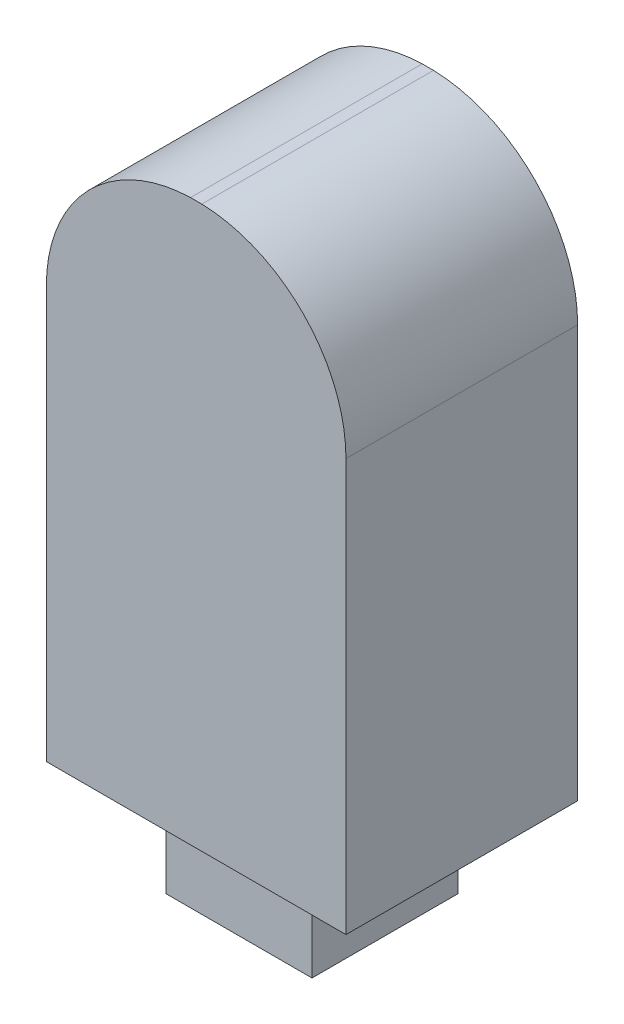
ISO-10303-21;
HEADER;
FILE_DESCRIPTION(('STEP AP214'),'2;1');
FILE_NAME('part.step','',(''),(''),'','','');
FILE_SCHEMA(('AUTOMOTIVE_DESIGN { 1 0 10303 214 1 1 1 1 }'));
ENDSEC;
DATA;
#1=APPLICATION_CONTEXT('core data for automotive mechanical design processes');
#2=APPLICATION_PROTOCOL_DEFINITION('international standard','automotive_design',2000,#1);
#3=PRODUCT_CONTEXT('',#1,'mechanical');
#4=PRODUCT('Part','Part','',(#3));
#5=PRODUCT_RELATED_PRODUCT_CATEGORY('part','',(#4));
#6=PRODUCT_DEFINITION_FORMATION('','',#4);
#7=PRODUCT_DEFINITION_CONTEXT('part definition',#1,'design');
#8=PRODUCT_DEFINITION('design','',#6,#7);
#9=PRODUCT_DEFINITION_SHAPE('','',#8);
#10=(LENGTH_UNIT() NAMED_UNIT(*) SI_UNIT(.MILLI.,.METRE.));
#11=(NAMED_UNIT(*) PLANE_ANGLE_UNIT() SI_UNIT($,.RADIAN.));
#12=(NAMED_UNIT(*) SI_UNIT($,.STERADIAN.) SOLID_ANGLE_UNIT());
#13=UNCERTAINTY_MEASURE_WITH_UNIT(LENGTH_MEASURE(1.E-05),#10,'distance_accuracy_value','');
#14=(GEOMETRIC_REPRESENTATION_CONTEXT(3) GLOBAL_UNCERTAINTY_ASSIGNED_CONTEXT((#13)) GLOBAL_UNIT_ASSIGNED_CONTEXT((#10,
#11,#12)) REPRESENTATION_CONTEXT('',''));
#15=CARTESIAN_POINT('',(0.,0.,0.));
#16=DIRECTION('',(0.,0.,1.));
#17=DIRECTION('',(1.,0.,0.));
#18=AXIS2_PLACEMENT_3D('',#15,#16,#17);
#19=CARTESIAN_POINT('',(0.,-12.7,7.1374));
#20=DIRECTION('',(0.,1.,0.));
#21=DIRECTION('',(0.,0.,1.));
#22=AXIS2_PLACEMENT_3D('',#19,#20,#21);
#23=PLANE('',#22);
#24=DIRECTION('',(1.,0.,0.));
#25=VECTOR('',#24,1.);
#26=CARTESIAN_POINT('',(0.,-12.7,0.));
#27=LINE('',#26,#25);
#28=CARTESIAN_POINT('',(0.,-12.7,0.));
#29=VERTEX_POINT('',#28);
#30=CARTESIAN_POINT('',(9.23036,-12.7,0.));
#31=VERTEX_POINT('',#30);
#32=EDGE_CURVE('E180',#29,#31,#27,.T.);
#33=ORIENTED_EDGE('',*,*,#32,.T.);
#34=DIRECTION('',(0.,0.,-1.));
#35=VECTOR('',#34,1.);
#36=CARTESIAN_POINT('',(9.23036,-12.7,7.1374));
#37=LINE('',#36,#35);
#38=CARTESIAN_POINT('',(9.23036,-12.7,7.1374));
#39=VERTEX_POINT('',#38);
#40=EDGE_CURVE('E202',#39,#31,#37,.T.);
#41=ORIENTED_EDGE('',*,*,#40,.F.);
#42=DIRECTION('',(1.,0.,0.));
#43=VECTOR('',#42,1.);
#44=CARTESIAN_POINT('',(0.,-12.7,7.1374));
#45=LINE('',#44,#43);
#46=CARTESIAN_POINT('',(0.,-12.7,7.1374));
#47=VERTEX_POINT('',#46);
#48=EDGE_CURVE('E165',#47,#39,#45,.T.);
#49=ORIENTED_EDGE('',*,*,#48,.F.);
#50=DIRECTION('',(0.,0.,-1.));
#51=VECTOR('',#50,1.);
#52=CARTESIAN_POINT('',(0.,-12.7,7.1374));
#53=LINE('',#52,#51);
#54=EDGE_CURVE('E54',#47,#29,#53,.T.);
#55=ORIENTED_EDGE('',*,*,#54,.T.);
#56=EDGE_LOOP('',(#33,#41,#49,#55));
#57=FACE_BOUND('',#56,.T.);
#58=DIRECTION('',(0.,0.,-1.));
#59=VECTOR('',#58,1.);
#60=CARTESIAN_POINT('',(2.36518,-12.7,1.3187));
#61=LINE('',#60,#59);
#62=CARTESIAN_POINT('',(2.36518,-12.7,5.8187));
#63=VERTEX_POINT('',#62);
#64=CARTESIAN_POINT('',(2.36518,-12.7,1.3187));
#65=VERTEX_POINT('',#64);
#66=EDGE_CURVE('E61',#63,#65,#61,.T.);
#67=ORIENTED_EDGE('',*,*,#66,.F.);
#68=DIRECTION('',(-1.,0.,0.));
#69=VECTOR('',#68,1.);
#70=CARTESIAN_POINT('',(6.86518,-12.7,5.8187));
#71=LINE('',#70,#69);
#72=CARTESIAN_POINT('',(6.86518,-12.7,5.8187));
#73=VERTEX_POINT('',#72);
#74=EDGE_CURVE('E65',#73,#63,#71,.T.);
#75=ORIENTED_EDGE('',*,*,#74,.F.);
#76=DIRECTION('',(0.,0.,1.));
#77=VECTOR('',#76,1.);
#78=CARTESIAN_POINT('',(6.86518,-12.7,1.3187));
#79=LINE('',#78,#77);
#80=CARTESIAN_POINT('',(6.86518,-12.7,1.3187));
#81=VERTEX_POINT('',#80);
#82=EDGE_CURVE('E336',#81,#73,#79,.T.);
#83=ORIENTED_EDGE('',*,*,#82,.F.);
#84=DIRECTION('',(1.,0.,0.));
#85=VECTOR('',#84,1.);
#86=CARTESIAN_POINT('',(6.86518,-12.7,1.3187));
#87=LINE('',#86,#85);
#88=EDGE_CURVE('E346',#65,#81,#87,.T.);
#89=ORIENTED_EDGE('',*,*,#88,.F.);
#90=EDGE_LOOP('',(#67,#75,#83,#89));
#91=FACE_BOUND('',#90,.T.);
#92=ADVANCED_FACE('F45',(#57,#91),#23,.F.);
#93=CARTESIAN_POINT('',(4.572,0.,7.1374));
#94=DIRECTION('',(0.,0.,-1.));
#95=DIRECTION('',(-1.,0.,0.));
#96=AXIS2_PLACEMENT_3D('',#93,#94,#95);
#97=CYLINDRICAL_SURFACE('',#96,4.572);
#98=CARTESIAN_POINT('',(4.572,0.,0.));
#99=DIRECTION('',(0.,0.,1.));
#100=DIRECTION('',(-1.,0.,0.));
#101=AXIS2_PLACEMENT_3D('',#98,#99,#100);
#102=CIRCLE('',#101,4.572);
#103=CARTESIAN_POINT('',(4.4414628273546,4.57013610809982,0.));
#104=VERTEX_POINT('',#103);
#105=CARTESIAN_POINT('',(0.,0.,0.));
#106=VERTEX_POINT('',#105);
#107=EDGE_CURVE('E146',#104,#106,#102,.T.);
#108=ORIENTED_EDGE('',*,*,#107,.T.);
#109=DIRECTION('',(0.,0.,-1.));
#110=VECTOR('',#109,1.);
#111=CARTESIAN_POINT('',(0.,0.,7.1374));
#112=LINE('',#111,#110);
#113=CARTESIAN_POINT('',(0.,0.,7.1374));
#114=VERTEX_POINT('',#113);
#115=EDGE_CURVE('E11',#114,#106,#112,.T.);
#116=ORIENTED_EDGE('',*,*,#115,.F.);
#117=CARTESIAN_POINT('',(4.572,0.,7.1374));
#118=DIRECTION('',(0.,0.,1.));
#119=DIRECTION('',(-1.,0.,0.));
#120=AXIS2_PLACEMENT_3D('',#117,#118,#119);
#121=CIRCLE('',#120,4.572);
#122=CARTESIAN_POINT('',(4.4414628273546,4.57013610809982,7.1374));
#123=VERTEX_POINT('',#122);
#124=EDGE_CURVE('E157',#123,#114,#121,.T.);
#125=ORIENTED_EDGE('',*,*,#124,.F.);
#126=DIRECTION('',(0.,0.,-1.));
#127=VECTOR('',#126,1.);
#128=CARTESIAN_POINT('',(4.4414628273546,4.57013610809982,7.1374));
#129=LINE('',#128,#127);
#130=EDGE_CURVE('E176',#123,#104,#129,.T.);
#131=ORIENTED_EDGE('',*,*,#130,.T.);
#132=EDGE_LOOP('',(#108,#116,#125,#131));
#133=FACE_BOUND('',#132,.T.);
#134=ADVANCED_FACE('F47',(#133),#97,.T.);
#135=CARTESIAN_POINT('',(0.,0.,7.1374));
#136=DIRECTION('',(1.,0.,0.));
#137=DIRECTION('',(0.,1.,0.));
#138=AXIS2_PLACEMENT_3D('',#135,#136,#137);
#139=PLANE('',#138);
#140=DIRECTION('',(0.,-1.,0.));
#141=VECTOR('',#140,1.);
#142=CARTESIAN_POINT('',(0.,0.,0.));
#143=LINE('',#142,#141);
#144=EDGE_CURVE('E151',#106,#29,#143,.T.);
#145=ORIENTED_EDGE('',*,*,#144,.T.);
#146=ORIENTED_EDGE('',*,*,#54,.F.);
#147=DIRECTION('',(0.,-1.,0.));
#148=VECTOR('',#147,1.);
#149=CARTESIAN_POINT('',(0.,0.,7.1374));
#150=LINE('',#149,#148);
#151=EDGE_CURVE('E161',#114,#47,#150,.T.);
#152=ORIENTED_EDGE('',*,*,#151,.F.);
#153=ORIENTED_EDGE('',*,*,#115,.T.);
#154=EDGE_LOOP('',(#145,#146,#152,#153));
#155=FACE_BOUND('',#154,.T.);
#156=ADVANCED_FACE('F233',(#155),#139,.F.);
#157=CARTESIAN_POINT('',(9.23036,-12.7,7.1374));
#158=DIRECTION('',(-1.,0.,0.));
#159=DIRECTION('',(0.,0.,1.));
#160=AXIS2_PLACEMENT_3D('',#157,#158,#159);
#161=PLANE('',#160);
#162=DIRECTION('',(0.,1.,0.));
#163=VECTOR('',#162,1.);
#164=CARTESIAN_POINT('',(9.23036,-12.7,0.));
#165=LINE('',#164,#163);
#166=CARTESIAN_POINT('',(9.23036,0.,0.));
#167=VERTEX_POINT('',#166);
#168=EDGE_CURVE('E183',#31,#167,#165,.T.);
#169=ORIENTED_EDGE('',*,*,#168,.T.);
#170=DIRECTION('',(0.,0.,-1.));
#171=VECTOR('',#170,1.);
#172=CARTESIAN_POINT('',(9.23036,0.,7.1374));
#173=LINE('',#172,#171);
#174=CARTESIAN_POINT('',(9.23036,0.,7.1374));
#175=VERTEX_POINT('',#174);
#176=EDGE_CURVE('E198',#175,#167,#173,.T.);
#177=ORIENTED_EDGE('',*,*,#176,.F.);
#178=DIRECTION('',(0.,1.,0.));
#179=VECTOR('',#178,1.);
#180=CARTESIAN_POINT('',(9.23036,-12.7,7.1374));
#181=LINE('',#180,#179);
#182=EDGE_CURVE('E168',#39,#175,#181,.T.);
#183=ORIENTED_EDGE('',*,*,#182,.F.);
#184=ORIENTED_EDGE('',*,*,#40,.T.);
#185=EDGE_LOOP('',(#169,#177,#183,#184));
#186=FACE_BOUND('',#185,.T.);
#187=ADVANCED_FACE('F221',(#186),#161,.F.);
#188=CARTESIAN_POINT('',(4.65836,0.,7.1374));
#189=DIRECTION('',(0.,0.,-1.));
#190=DIRECTION('',(-1.,0.,0.));
#191=AXIS2_PLACEMENT_3D('',#188,#189,#190);
#192=CYLINDRICAL_SURFACE('',#191,4.572);
#193=CARTESIAN_POINT('',(4.65836,0.,0.));
#194=DIRECTION('',(0.,0.,1.));
#195=DIRECTION('',(1.,0.,0.));
#196=AXIS2_PLACEMENT_3D('',#193,#194,#195);
#197=CIRCLE('',#196,4.572);
#198=CARTESIAN_POINT('',(4.78889717264541,4.57013610809982,0.));
#199=VERTEX_POINT('',#198);
#200=EDGE_CURVE('E186',#167,#199,#197,.T.);
#201=ORIENTED_EDGE('',*,*,#200,.T.);
#202=DIRECTION('',(0.,0.,-1.));
#203=VECTOR('',#202,1.);
#204=CARTESIAN_POINT('',(4.78889717264541,4.57013610809982,7.1374));
#205=LINE('',#204,#203);
#206=CARTESIAN_POINT('',(4.78889717264541,4.57013610809982,7.1374));
#207=VERTEX_POINT('',#206);
#208=EDGE_CURVE('E194',#207,#199,#205,.T.);
#209=ORIENTED_EDGE('',*,*,#208,.F.);
#210=CARTESIAN_POINT('',(4.65836,0.,7.1374));
#211=DIRECTION('',(0.,0.,1.));
#212=DIRECTION('',(1.,0.,0.));
#213=AXIS2_PLACEMENT_3D('',#210,#211,#212);
#214=CIRCLE('',#213,4.572);
#215=EDGE_CURVE('E171',#175,#207,#214,.T.);
#216=ORIENTED_EDGE('',*,*,#215,.F.);
#217=ORIENTED_EDGE('',*,*,#176,.T.);
#218=EDGE_LOOP('',(#201,#209,#216,#217));
#219=FACE_BOUND('',#218,.T.);
#220=ADVANCED_FACE('F225',(#219),#192,.T.);
#221=CARTESIAN_POINT('',(4.4414628273546,4.57013610809982,7.1374));
#222=DIRECTION('',(0.,-1.,0.));
#223=DIRECTION('',(0.,0.,-1.));
#224=AXIS2_PLACEMENT_3D('',#221,#222,#223);
#225=PLANE('',#224);
#226=DIRECTION('',(-1.,0.,0.));
#227=VECTOR('',#226,1.);
#228=CARTESIAN_POINT('',(4.4414628273546,4.57013610809982,0.));
#229=LINE('',#228,#227);
#230=EDGE_CURVE('E162',#199,#104,#229,.T.);
#231=ORIENTED_EDGE('',*,*,#230,.T.);
#232=ORIENTED_EDGE('',*,*,#130,.F.);
#233=DIRECTION('',(-1.,0.,0.));
#234=VECTOR('',#233,1.);
#235=CARTESIAN_POINT('',(4.4414628273546,4.57013610809982,7.1374));
#236=LINE('',#235,#234);
#237=EDGE_CURVE('E174',#207,#123,#236,.T.);
#238=ORIENTED_EDGE('',*,*,#237,.F.);
#239=ORIENTED_EDGE('',*,*,#208,.T.);
#240=EDGE_LOOP('',(#231,#232,#238,#239));
#241=FACE_BOUND('',#240,.T.);
#242=ADVANCED_FACE('F236',(#241),#225,.F.);
#243=CARTESIAN_POINT('',(4.572,0.,7.1374));
#244=DIRECTION('',(0.,0.,-1.));
#245=DIRECTION('',(-1.,0.,0.));
#246=AXIS2_PLACEMENT_3D('',#243,#244,#245);
#247=PLANE('',#246);
#248=ORIENTED_EDGE('',*,*,#124,.T.);
#249=ORIENTED_EDGE('',*,*,#151,.T.);
#250=ORIENTED_EDGE('',*,*,#48,.T.);
#251=ORIENTED_EDGE('',*,*,#182,.T.);
#252=ORIENTED_EDGE('',*,*,#215,.T.);
#253=ORIENTED_EDGE('',*,*,#237,.T.);
#254=EDGE_LOOP('',(#248,#249,#250,#251,#252,#253));
#255=FACE_BOUND('',#254,.T.);
#256=ADVANCED_FACE('F229',(#255),#247,.F.);
#257=CARTESIAN_POINT('',(4.572,0.,0.));
#258=DIRECTION('',(0.,0.,-1.));
#259=DIRECTION('',(-1.,0.,0.));
#260=AXIS2_PLACEMENT_3D('',#257,#258,#259);
#261=PLANE('',#260);
#262=ORIENTED_EDGE('',*,*,#107,.F.);
#263=ORIENTED_EDGE('',*,*,#230,.F.);
#264=ORIENTED_EDGE('',*,*,#200,.F.);
#265=ORIENTED_EDGE('',*,*,#168,.F.);
#266=ORIENTED_EDGE('',*,*,#32,.F.);
#267=ORIENTED_EDGE('',*,*,#144,.F.);
#268=EDGE_LOOP('',(#262,#263,#264,#265,#266,#267));
#269=FACE_BOUND('',#268,.T.);
#270=ADVANCED_FACE('F216',(#269),#261,.T.);
#271=CARTESIAN_POINT('',(2.36518,-15.7,1.3187));
#272=DIRECTION('',(1.,0.,0.));
#273=DIRECTION('',(0.,0.,-1.));
#274=AXIS2_PLACEMENT_3D('',#271,#272,#273);
#275=PLANE('',#274);
#276=ORIENTED_EDGE('',*,*,#66,.T.);
#277=DIRECTION('',(0.,1.,0.));
#278=VECTOR('',#277,1.);
#279=CARTESIAN_POINT('',(2.36518,-15.7,1.3187));
#280=LINE('',#279,#278);
#281=CARTESIAN_POINT('',(2.36518,-15.7,1.3187));
#282=VERTEX_POINT('',#281);
#283=EDGE_CURVE('E126',#282,#65,#280,.T.);
#284=ORIENTED_EDGE('',*,*,#283,.F.);
#285=DIRECTION('',(0.,0.,-1.));
#286=VECTOR('',#285,1.);
#287=CARTESIAN_POINT('',(2.36518,-15.7,1.3187));
#288=LINE('',#287,#286);
#289=CARTESIAN_POINT('',(2.36518,-15.7,5.8187));
#290=VERTEX_POINT('',#289);
#291=EDGE_CURVE('E133',#290,#282,#288,.T.);
#292=ORIENTED_EDGE('',*,*,#291,.F.);
#293=DIRECTION('',(0.,1.,0.));
#294=VECTOR('',#293,1.);
#295=CARTESIAN_POINT('',(2.36518,-15.7,5.8187));
#296=LINE('',#295,#294);
#297=EDGE_CURVE('E333',#290,#63,#296,.T.);
#298=ORIENTED_EDGE('',*,*,#297,.T.);
#299=EDGE_LOOP('',(#276,#284,#292,#298));
#300=FACE_BOUND('',#299,.T.);
#301=ADVANCED_FACE('F144',(#300),#275,.F.);
#302=CARTESIAN_POINT('',(6.86518,-15.7,1.3187));
#303=DIRECTION('',(0.,0.,1.));
#304=DIRECTION('',(1.,0.,0.));
#305=AXIS2_PLACEMENT_3D('',#302,#303,#304);
#306=PLANE('',#305);
#307=ORIENTED_EDGE('',*,*,#88,.T.);
#308=DIRECTION('',(0.,1.,0.));
#309=VECTOR('',#308,1.);
#310=CARTESIAN_POINT('',(6.86518,-15.7,1.3187));
#311=LINE('',#310,#309);
#312=CARTESIAN_POINT('',(6.86518,-15.7,1.3187));
#313=VERTEX_POINT('',#312);
#314=EDGE_CURVE('E128',#313,#81,#311,.T.);
#315=ORIENTED_EDGE('',*,*,#314,.F.);
#316=DIRECTION('',(1.,0.,0.));
#317=VECTOR('',#316,1.);
#318=CARTESIAN_POINT('',(6.86518,-15.7,1.3187));
#319=LINE('',#318,#317);
#320=EDGE_CURVE('E121',#282,#313,#319,.T.);
#321=ORIENTED_EDGE('',*,*,#320,.F.);
#322=ORIENTED_EDGE('',*,*,#283,.T.);
#323=EDGE_LOOP('',(#307,#315,#321,#322));
#324=FACE_BOUND('',#323,.T.);
#325=ADVANCED_FACE('F124',(#324),#306,.F.);
#326=CARTESIAN_POINT('',(6.86518,-15.7,1.3187));
#327=DIRECTION('',(-1.,0.,0.));
#328=DIRECTION('',(0.,0.,1.));
#329=AXIS2_PLACEMENT_3D('',#326,#327,#328);
#330=PLANE('',#329);
#331=ORIENTED_EDGE('',*,*,#82,.T.);
#332=DIRECTION('',(0.,1.,0.));
#333=VECTOR('',#332,1.);
#334=CARTESIAN_POINT('',(6.86518,-15.7,5.8187));
#335=LINE('',#334,#333);
#336=CARTESIAN_POINT('',(6.86518,-15.7,5.8187));
#337=VERTEX_POINT('',#336);
#338=EDGE_CURVE('E153',#337,#73,#335,.T.);
#339=ORIENTED_EDGE('',*,*,#338,.F.);
#340=DIRECTION('',(0.,0.,1.));
#341=VECTOR('',#340,1.);
#342=CARTESIAN_POINT('',(6.86518,-15.7,1.3187));
#343=LINE('',#342,#341);
#344=EDGE_CURVE('E132',#313,#337,#343,.T.);
#345=ORIENTED_EDGE('',*,*,#344,.F.);
#346=ORIENTED_EDGE('',*,*,#314,.T.);
#347=EDGE_LOOP('',(#331,#339,#345,#346));
#348=FACE_BOUND('',#347,.T.);
#349=ADVANCED_FACE('F302',(#348),#330,.F.);
#350=CARTESIAN_POINT('',(6.86518,-15.7,5.8187));
#351=DIRECTION('',(0.,0.,-1.));
#352=DIRECTION('',(-1.,0.,0.));
#353=AXIS2_PLACEMENT_3D('',#350,#351,#352);
#354=PLANE('',#353);
#355=ORIENTED_EDGE('',*,*,#74,.T.);
#356=ORIENTED_EDGE('',*,*,#297,.F.);
#357=DIRECTION('',(-1.,0.,0.));
#358=VECTOR('',#357,1.);
#359=CARTESIAN_POINT('',(6.86518,-15.7,5.8187));
#360=LINE('',#359,#358);
#361=EDGE_CURVE('E138',#337,#290,#360,.T.);
#362=ORIENTED_EDGE('',*,*,#361,.F.);
#363=ORIENTED_EDGE('',*,*,#338,.T.);
#364=EDGE_LOOP('',(#355,#356,#362,#363));
#365=FACE_BOUND('',#364,.T.);
#366=ADVANCED_FACE('F311',(#365),#354,.F.);
#367=CARTESIAN_POINT('',(0.,-15.7,0.));
#368=DIRECTION('',(0.,-1.,0.));
#369=DIRECTION('',(0.,0.,-1.));
#370=AXIS2_PLACEMENT_3D('',#367,#368,#369);
#371=PLANE('',#370);
#372=ORIENTED_EDGE('',*,*,#291,.T.);
#373=ORIENTED_EDGE('',*,*,#320,.T.);
#374=ORIENTED_EDGE('',*,*,#344,.T.);
#375=ORIENTED_EDGE('',*,*,#361,.T.);
#376=EDGE_LOOP('',(#372,#373,#374,#375));
#377=FACE_BOUND('',#376,.T.);
#378=ADVANCED_FACE('F136',(#377),#371,.T.);
#379=CLOSED_SHELL('',(#92,#134,#156,#187,#220,#242,#256,#270,#301,#325,#349,#366,#378));
#380=MANIFOLD_SOLID_BREP('B2',#379);
#381=ADVANCED_BREP_SHAPE_REPRESENTATION('',(#18,#380),#14);
#382=SHAPE_DEFINITION_REPRESENTATION(#9,#381);
ENDSEC;
END-ISO-10303-21;
